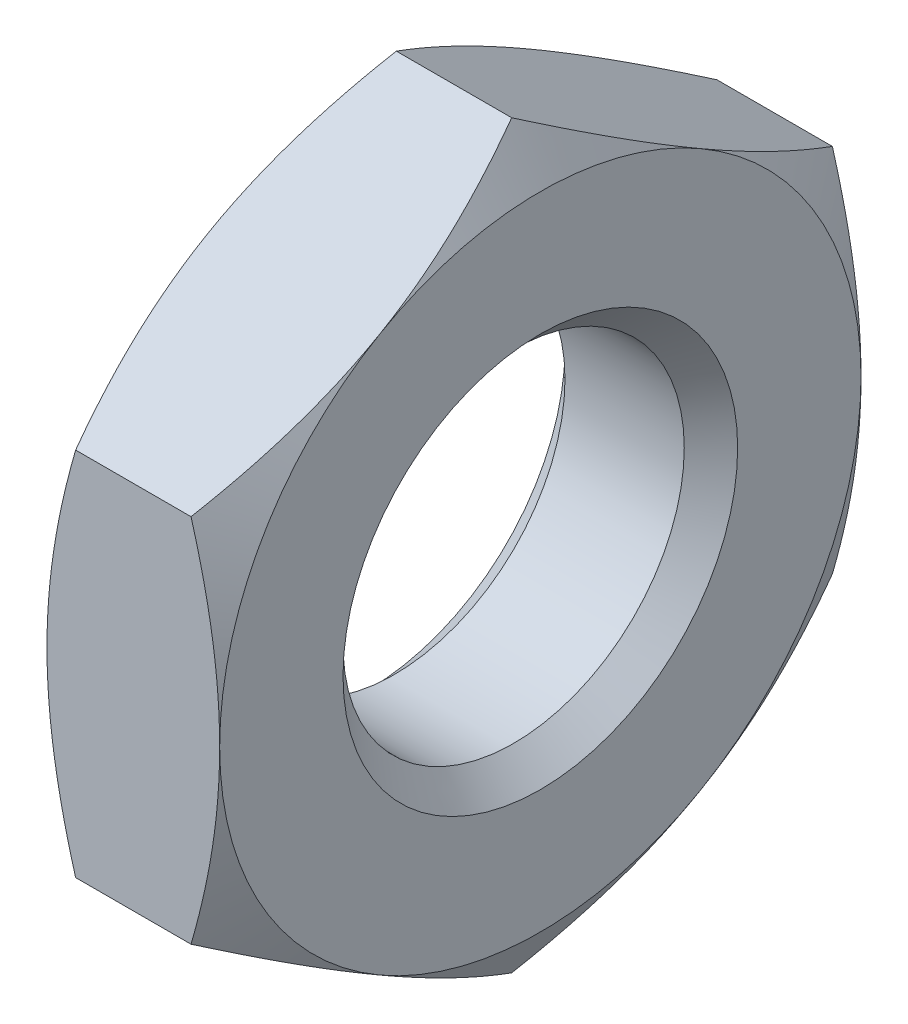
ISO-10303-21;
HEADER;
FILE_DESCRIPTION(('STEP AP214'),'2;1');
FILE_NAME('part.step','',(''),(''),'','','');
FILE_SCHEMA(('AUTOMOTIVE_DESIGN { 1 0 10303 214 1 1 1 1 }'));
ENDSEC;
DATA;
#1=APPLICATION_CONTEXT('core data for automotive mechanical design processes');
#2=APPLICATION_PROTOCOL_DEFINITION('international standard','automotive_design',2000,#1);
#3=PRODUCT_CONTEXT('',#1,'mechanical');
#4=PRODUCT('Part','Part','',(#3));
#5=PRODUCT_RELATED_PRODUCT_CATEGORY('part','',(#4));
#6=PRODUCT_DEFINITION_FORMATION('','',#4);
#7=PRODUCT_DEFINITION_CONTEXT('part definition',#1,'design');
#8=PRODUCT_DEFINITION('design','',#6,#7);
#9=PRODUCT_DEFINITION_SHAPE('','',#8);
#10=(LENGTH_UNIT() NAMED_UNIT(*) SI_UNIT(.MILLI.,.METRE.));
#11=(NAMED_UNIT(*) PLANE_ANGLE_UNIT() SI_UNIT($,.RADIAN.));
#12=(NAMED_UNIT(*) SI_UNIT($,.STERADIAN.) SOLID_ANGLE_UNIT());
#13=UNCERTAINTY_MEASURE_WITH_UNIT(LENGTH_MEASURE(1.E-05),#10,'distance_accuracy_value','');
#14=(GEOMETRIC_REPRESENTATION_CONTEXT(3) GLOBAL_UNCERTAINTY_ASSIGNED_CONTEXT((#13)) GLOBAL_UNIT_ASSIGNED_CONTEXT((#10,
#11,#12)) REPRESENTATION_CONTEXT('',''));
#15=CARTESIAN_POINT('',(0.,0.,0.));
#16=DIRECTION('',(0.,0.,1.));
#17=DIRECTION('',(1.,0.,0.));
#18=AXIS2_PLACEMENT_3D('',#15,#16,#17);
#19=CARTESIAN_POINT('',(20.,0.,0.));
#20=DIRECTION('',(1.,0.,0.));
#21=DIRECTION('',(0.,0.,1.));
#22=AXIS2_PLACEMENT_3D('',#19,#20,#21);
#23=CONICAL_SURFACE('',#22,6.5,1.0471975511966);
#24=CARTESIAN_POINT('',(20.5805572502676,7.50555465416567,1.99999999888977E-06));
#25=CARTESIAN_POINT('',(20.5329411522362,7.42306527723567,-0.142873791927455));
#26=CARTESIAN_POINT('',(20.4874862264941,7.34026834106243,-0.286282292090548));
#27=CARTESIAN_POINT('',(20.4014939227888,7.17400208014972,-0.574263903575863));
#28=CARTESIAN_POINT('',(20.3609586661771,7.09053248178623,-0.718837488828798));
#29=CARTESIAN_POINT('',(20.2475281183766,6.83878732720466,-1.15487288712335));
#30=CARTESIAN_POINT('',(20.1830111190427,6.66951807893899,-1.44805582527849));
#31=CARTESIAN_POINT('',(20.1073591259132,6.41620974890769,-1.88679872287313));
#32=CARTESIAN_POINT('',(20.0858084178639,6.33292745266913,-2.0310478913293));
#33=CARTESIAN_POINT('',(20.0496718853767,6.16598660334749,-2.32019792421309));
#34=CARTESIAN_POINT('',(20.0350854455776,6.08232808416699,-2.46509872991969));
#35=CARTESIAN_POINT('',(20.0132491881389,5.91486579606871,-2.75515192125765));
#36=CARTESIAN_POINT('',(20.0059910453223,5.83106230055643,-2.90030383333679));
#37=CARTESIAN_POINT('',(19.9989592217746,5.66338258203352,-3.19073362521733));
#38=CARTESIAN_POINT('',(19.9991853097409,5.5795063613506,-3.33601150098701));
#39=CARTESIAN_POINT('',(20.0100914728005,5.34972711742178,-3.73400082599649));
#40=CARTESIAN_POINT('',(20.0283909317871,5.20389935455449,-3.98658192043674));
#41=CARTESIAN_POINT('',(20.0864124807486,4.91321237846649,-4.49006653211969));
#42=CARTESIAN_POINT('',(20.1261543917517,4.7683541871297,-4.74096827940755));
#43=CARTESIAN_POINT('',(20.2254952028274,4.47708246697613,-5.24546569752153));
#44=CARTESIAN_POINT('',(20.285514893733,4.33070568094781,-5.49899772797121));
#45=CARTESIAN_POINT('',(20.4217344418106,4.04013468328328,-6.00228145913216));
#46=CARTESIAN_POINT('',(20.4979023128666,3.89593675196615,-6.25203960251976));
#47=CARTESIAN_POINT('',(20.5805572502676,3.75277559503203,-6.500002));
#48=B_SPLINE_CURVE_WITH_KNOTS('',3,(#24,#25,#26,#27,#28,#29,#30,#31,#32,#33,#34,#35,#36,#37,#38,
#39,#40,#41,#42,#43,#44,#45,#46,#47),.UNSPECIFIED.,.F.,.F.,(4,2,2,2,2,2,2,2,2,2,2,4),(0.,
0.5150972308121,1.03041578730196,2.0631938175307,2.56693508465117,3.07063183306576,
3.5737557200387,4.07686405782424,4.95263248446346,5.82921184659663,6.72522956997887,
7.61948878328295),.UNSPECIFIED.);
#49=CARTESIAN_POINT('',(20.,5.62916512459885,-3.25));
#50=VERTEX_POINT('',#49);
#51=CARTESIAN_POINT('',(20.5805565836007,3.75277674973256,-6.5));
#52=VERTEX_POINT('',#51);
#53=EDGE_CURVE('E233',#50,#52,#48,.T.);
#54=ORIENTED_EDGE('',*,*,#53,.T.);
#55=CARTESIAN_POINT('',(23.1104989341359,9.95307285908935,-6.5));
#56=CARTESIAN_POINT('',(22.9725830553751,9.66768488978743,-6.5));
#57=CARTESIAN_POINT('',(22.8360381273745,9.38162218475457,-6.5));
#58=CARTESIAN_POINT('',(22.5664735764141,8.8077824797937,-6.5));
#59=CARTESIAN_POINT('',(22.433454563785,8.52000519349761,-6.5));
#60=CARTESIAN_POINT('',(22.1710245296496,7.940817029875,-6.5));
#61=CARTESIAN_POINT('',(22.0416385098717,7.64939478323305,-6.5));
#62=CARTESIAN_POINT('',(21.7884236931739,7.06415509657549,-6.5));
#63=CARTESIAN_POINT('',(21.6645946065949,6.77033778235014,-6.5));
#64=CARTESIAN_POINT('',(21.4225009036852,6.17619249466497,-6.5));
#65=CARTESIAN_POINT('',(21.3043232869134,5.875828877051,-6.5));
#66=CARTESIAN_POINT('',(21.0772233740448,5.27155865332413,-6.5));
#67=CARTESIAN_POINT('',(20.9683021076494,4.96765165730143,-6.5));
#68=CARTESIAN_POINT('',(20.7626411634057,4.35643639784011,-6.5));
#69=CARTESIAN_POINT('',(20.6658755889185,4.04913693634067,-6.5));
#70=CARTESIAN_POINT('',(20.4876696862604,3.43016616038199,-6.5));
#71=CARTESIAN_POINT('',(20.4062245118597,3.11849626203733,-6.5));
#72=CARTESIAN_POINT('',(20.262609080276,2.49058681273852,-6.5));
#73=CARTESIAN_POINT('',(20.200443946994,2.17434607035871,-6.5));
#74=CARTESIAN_POINT('',(20.0995896083704,1.53800734029216,-6.5));
#75=CARTESIAN_POINT('',(20.0609004236126,1.21790934922361,-6.5));
#76=CARTESIAN_POINT('',(20.0229537732643,0.737252871284541,-6.5));
#77=CARTESIAN_POINT('',(20.0136508237313,0.577446868410647,-6.5));
#78=CARTESIAN_POINT('',(20.0018165473539,0.257576967669783,-6.5));
#79=CARTESIAN_POINT('',(19.9992851325544,0.0975130731795695,-6.5));
#80=CARTESIAN_POINT('',(20.0010619211028,-0.222530422340152,-6.5));
#81=CARTESIAN_POINT('',(20.0053682047385,-0.382510034418978,-6.5));
#82=CARTESIAN_POINT('',(20.0207112496698,-0.702148832131741,-6.5));
#83=CARTESIAN_POINT('',(20.031748347135,-0.861808001361582,-6.5));
#84=CARTESIAN_POINT('',(20.0664256973321,-1.2487675251381,-6.5));
#85=CARTESIAN_POINT('',(20.0934383147711,-1.47577055977928,-6.5));
#86=CARTESIAN_POINT('',(20.1595713659633,-1.92803729286361,-6.5));
#87=CARTESIAN_POINT('',(20.1986951044107,-2.15330049935346,-6.5));
#88=CARTESIAN_POINT('',(20.2876628717206,-2.60190162254788,-6.5));
#89=CARTESIAN_POINT('',(20.3375170362986,-2.82523750985595,-6.5));
#90=CARTESIAN_POINT('',(20.4464245194654,-3.26961152922599,-6.5));
#91=CARTESIAN_POINT('',(20.5054769714683,-3.49064987565263,-6.5));
#92=CARTESIAN_POINT('',(20.6329119477722,-3.93587314871609,-6.5));
#93=CARTESIAN_POINT('',(20.7014876979859,-4.16000238632252,-6.5));
#94=CARTESIAN_POINT('',(20.8454152109145,-4.60589181343482,-6.5));
#95=CARTESIAN_POINT('',(20.9207623000669,-4.82765352051654,-6.5));
#96=CARTESIAN_POINT('',(21.0766760952858,-5.26791804038343,-6.5));
#97=CARTESIAN_POINT('',(21.1572110352833,-5.48643217049917,-6.5));
#98=CARTESIAN_POINT('',(21.3230080720055,-5.921765035856,-6.5));
#99=CARTESIAN_POINT('',(21.4082720791541,-6.13858304495038,-6.5));
#100=CARTESIAN_POINT('',(21.495432818,-6.35461336357443,-6.5));
#101=B_SPLINE_CURVE_WITH_KNOTS('',3,(#55,#56,#57,#58,#59,#60,#61,#62,#63,#64,#65,#66,#67,#68,
#69,#70,#71,#72,#73,#74,#75,#76,#77,#78,#79,#80,#81,#82,#83,#84,#85,#86,#87,#88,#89,#90,#91,#92,
#93,#94,#95,#96,#97,#98,#99,#100),.UNSPECIFIED.,.F.,.F.,(4,2,2,2,2,2,2,2,2,2,2,2,2,2,2,2,2,2,2,
2,2,2,4),(0.,0.950909051370076,1.90198164276349,2.85849656625615,3.81496157264779,
4.78317137315413,5.75148873932465,6.71770688363885,7.68361887285431,8.64978734516563,
9.61595666461726,10.0960644432439,10.5761659857554,11.0561327615996,11.5361235112802,
12.2215554610679,12.9071746059577,13.5934442356332,14.2796492497687,14.9826753898829,
15.6852199758561,16.3838102365337,17.0826847952346),.UNSPECIFIED.);
#102=CARTESIAN_POINT('',(20.,0.,-6.5));
#103=VERTEX_POINT('',#102);
#104=EDGE_CURVE('E120',#52,#103,#101,.T.);
#105=ORIENTED_EDGE('',*,*,#104,.T.);
#106=CARTESIAN_POINT('',(20.,0.,0.));
#107=DIRECTION('',(-1.,0.,0.));
#108=DIRECTION('',(0.,0.,-1.));
#109=AXIS2_PLACEMENT_3D('',#106,#107,#108);
#110=CIRCLE('',#109,6.5);
#111=EDGE_CURVE('E265',#50,#103,#110,.T.);
#112=ORIENTED_EDGE('',*,*,#111,.F.);
#113=EDGE_LOOP('',(#54,#105,#112));
#114=FACE_BOUND('',#113,.T.);
#115=ADVANCED_FACE('F16',(#114),#23,.T.);
#116=CARTESIAN_POINT('',(20.,-5.62916512459885,-3.25));
#117=VERTEX_POINT('',#116);
#118=EDGE_CURVE('E257',#103,#117,#110,.T.);
#119=ORIENTED_EDGE('',*,*,#118,.F.);
#120=CARTESIAN_POINT('',(20.5805565836007,-3.75277674973257,-6.5));
#121=VERTEX_POINT('',#120);
#122=EDGE_CURVE('E226',#103,#121,#101,.T.);
#123=ORIENTED_EDGE('',*,*,#122,.T.);
#124=CARTESIAN_POINT('',(20.5805572502676,-3.75277559503203,-6.500002));
#125=CARTESIAN_POINT('',(20.5329411522362,-3.83526497196203,-6.35712620807255));
#126=CARTESIAN_POINT('',(20.4874862264941,-3.91806190813527,-6.21371770790945));
#127=CARTESIAN_POINT('',(20.4014939227888,-4.08432816904798,-5.92573609642414));
#128=CARTESIAN_POINT('',(20.3609586661771,-4.16779776741147,-5.7811625111712));
#129=CARTESIAN_POINT('',(20.2475281183766,-4.41954292199304,-5.34512711287665));
#130=CARTESIAN_POINT('',(20.1830111190428,-4.58881217025871,-5.05194417472151));
#131=CARTESIAN_POINT('',(20.1073591259132,-4.84212050029002,-4.61320127712687));
#132=CARTESIAN_POINT('',(20.0858084178639,-4.92540279652857,-4.4689521086707));
#133=CARTESIAN_POINT('',(20.0496718853767,-5.09234364585021,-4.17980207578691));
#134=CARTESIAN_POINT('',(20.0350854455776,-5.17600216503071,-4.03490127008031));
#135=CARTESIAN_POINT('',(20.0132491881389,-5.34346445312899,-3.74484807874235));
#136=CARTESIAN_POINT('',(20.0059910453223,-5.42726794864127,-3.5996961666632));
#137=CARTESIAN_POINT('',(19.9989592217746,-5.59494766716419,-3.30926637478267));
#138=CARTESIAN_POINT('',(19.9991853097409,-5.67882388784711,-3.16398849901299));
#139=CARTESIAN_POINT('',(20.0100914728005,-5.90860313177593,-2.76599917400351));
#140=CARTESIAN_POINT('',(20.0283909317871,-6.05443089464322,-2.51341807956326));
#141=CARTESIAN_POINT('',(20.0864124807486,-6.34511787073121,-2.0099334678803));
#142=CARTESIAN_POINT('',(20.1261543917517,-6.489976062068,-1.75903172059245));
#143=CARTESIAN_POINT('',(20.2254952028274,-6.78124778222157,-1.25453430247847));
#144=CARTESIAN_POINT('',(20.285514893733,-6.92762456824989,-1.00100227202879));
#145=CARTESIAN_POINT('',(20.4217344418106,-7.21819556591443,-0.497718540867836));
#146=CARTESIAN_POINT('',(20.4979023128666,-7.36239349723155,-0.247960397480243));
#147=CARTESIAN_POINT('',(20.5805572502676,-7.50555465416567,2.00000000016023E-06));
#148=B_SPLINE_CURVE_WITH_KNOTS('',3,(#124,#125,#126,#127,#128,#129,#130,#131,#132,#133,#134,
#135,#136,#137,#138,#139,#140,#141,#142,#143,#144,#145,#146,#147),.UNSPECIFIED.,.F.,.F.,(4,2,2,
2,2,2,2,2,2,2,2,4),(0.,0.5150972308121,1.03041578730196,2.0631938175307,2.56693508465117,
3.07063183306577,3.57375572003871,4.07686405782424,4.95263248446346,5.82921184659663,
6.72522956997887,7.61948878328295),.UNSPECIFIED.);
#149=EDGE_CURVE('E219',#121,#117,#148,.T.);
#150=ORIENTED_EDGE('',*,*,#149,.T.);
#151=EDGE_LOOP('',(#119,#123,#150));
#152=FACE_BOUND('',#151,.T.);
#153=ADVANCED_FACE('F254',(#152),#23,.T.);
#154=CARTESIAN_POINT('',(20.,-5.62916512459885,3.25));
#155=VERTEX_POINT('',#154);
#156=EDGE_CURVE('E263',#117,#155,#110,.T.);
#157=ORIENTED_EDGE('',*,*,#156,.F.);
#158=CARTESIAN_POINT('',(20.5805565836007,-7.50555349946514,0.));
#159=VERTEX_POINT('',#158);
#160=EDGE_CURVE('E210',#117,#159,#148,.T.);
#161=ORIENTED_EDGE('',*,*,#160,.T.);
#162=CARTESIAN_POINT('',(20.5805572502676,-7.50555465416567,-1.99999999954043E-06));
#163=CARTESIAN_POINT('',(20.5329411522362,-7.42306527723567,0.142873791927452));
#164=CARTESIAN_POINT('',(20.4874862264941,-7.34026834106243,0.286282292090546));
#165=CARTESIAN_POINT('',(20.4014939227888,-7.17400208014972,0.574263903575861));
#166=CARTESIAN_POINT('',(20.3609586661771,-7.09053248178623,0.718837488828797));
#167=CARTESIAN_POINT('',(20.2475281183766,-6.83878732720467,1.15487288712335));
#168=CARTESIAN_POINT('',(20.1830111190428,-6.66951807893899,1.44805582527848));
#169=CARTESIAN_POINT('',(20.1073591259132,-6.41620974890769,1.88679872287312));
#170=CARTESIAN_POINT('',(20.0858084178639,-6.33292745266914,2.0310478913293));
#171=CARTESIAN_POINT('',(20.0496718853767,-6.16598660334749,2.32019792421309));
#172=CARTESIAN_POINT('',(20.0350854455776,-6.08232808416699,2.46509872991969));
#173=CARTESIAN_POINT('',(20.0132491881389,-5.91486579606872,2.75515192125765));
#174=CARTESIAN_POINT('',(20.0059910453223,-5.83106230055643,2.90030383333679));
#175=CARTESIAN_POINT('',(19.9989592217746,-5.66338258203352,3.19073362521732));
#176=CARTESIAN_POINT('',(19.9991853097409,-5.5795063613506,3.336011500987));
#177=CARTESIAN_POINT('',(20.0100914728005,-5.34972711742178,3.73400082599649));
#178=CARTESIAN_POINT('',(20.0283909317871,-5.20389935455449,3.98658192043674));
#179=CARTESIAN_POINT('',(20.0864124807486,-4.9132123784665,4.49006653211969));
#180=CARTESIAN_POINT('',(20.1261543917517,-4.7683541871297,4.74096827940755));
#181=CARTESIAN_POINT('',(20.2254952028274,-4.47708246697613,5.24546569752153));
#182=CARTESIAN_POINT('',(20.285514893733,-4.33070568094781,5.49899772797121));
#183=CARTESIAN_POINT('',(20.4217344418106,-4.04013468328328,6.00228145913217));
#184=CARTESIAN_POINT('',(20.4979023128666,-3.89593675196615,6.25203960251976));
#185=CARTESIAN_POINT('',(20.5805572502676,-3.75277559503203,6.500002));
#186=B_SPLINE_CURVE_WITH_KNOTS('',3,(#162,#163,#164,#165,#166,#167,#168,#169,#170,#171,#172,
#173,#174,#175,#176,#177,#178,#179,#180,#181,#182,#183,#184,#185),.UNSPECIFIED.,.F.,.F.,(4,2,2,
2,2,2,2,2,2,2,2,4),(0.,0.515097230812098,1.03041578730196,2.06319381753069,2.56693508465116,
3.07063183306576,3.5737557200387,4.07686405782423,4.95263248446346,5.82921184659663,
6.72522956997887,7.61948878328295),.UNSPECIFIED.);
#187=EDGE_CURVE('E372',#159,#155,#186,.T.);
#188=ORIENTED_EDGE('',*,*,#187,.T.);
#189=EDGE_LOOP('',(#157,#161,#188));
#190=FACE_BOUND('',#189,.T.);
#191=ADVANCED_FACE('F341',(#190),#23,.T.);
#192=CARTESIAN_POINT('',(20.5805572502676,3.75277559503204,6.500002));
#193=CARTESIAN_POINT('',(20.5329411522362,3.83526497196203,6.35712620807255));
#194=CARTESIAN_POINT('',(20.4874862264941,3.91806190813527,6.21371770790945));
#195=CARTESIAN_POINT('',(20.4014939227888,4.08432816904798,5.92573609642414));
#196=CARTESIAN_POINT('',(20.3609586661771,4.16779776741147,5.7811625111712));
#197=CARTESIAN_POINT('',(20.2475281183766,4.41954292199304,5.34512711287665));
#198=CARTESIAN_POINT('',(20.1830111190427,4.58881217025871,5.05194417472151));
#199=CARTESIAN_POINT('',(20.1073591259132,4.84212050029002,4.61320127712687));
#200=CARTESIAN_POINT('',(20.0858084178639,4.92540279652857,4.46895210867069));
#201=CARTESIAN_POINT('',(20.0496718853767,5.09234364585021,4.17980207578691));
#202=CARTESIAN_POINT('',(20.0350854455776,5.17600216503071,4.03490127008031));
#203=CARTESIAN_POINT('',(20.0132491881389,5.34346445312899,3.74484807874235));
#204=CARTESIAN_POINT('',(20.0059910453223,5.42726794864127,3.5996961666632));
#205=CARTESIAN_POINT('',(19.9989592217746,5.59494766716419,3.30926637478267));
#206=CARTESIAN_POINT('',(19.9991853097409,5.67882388784711,3.16398849901299));
#207=CARTESIAN_POINT('',(20.0100914728005,5.90860313177593,2.76599917400351));
#208=CARTESIAN_POINT('',(20.0283909317871,6.05443089464322,2.51341807956326));
#209=CARTESIAN_POINT('',(20.0864124807486,6.34511787073121,2.0099334678803));
#210=CARTESIAN_POINT('',(20.1261543917517,6.489976062068,1.75903172059244));
#211=CARTESIAN_POINT('',(20.2254952028274,6.78124778222157,1.25453430247847));
#212=CARTESIAN_POINT('',(20.285514893733,6.92762456824989,1.00100227202879));
#213=CARTESIAN_POINT('',(20.4217344418106,7.21819556591443,0.497718540867836));
#214=CARTESIAN_POINT('',(20.4979023128666,7.36239349723155,0.247960397480243));
#215=CARTESIAN_POINT('',(20.5805572502676,7.50555465416567,-2.00000000021285E-06));
#216=B_SPLINE_CURVE_WITH_KNOTS('',3,(#192,#193,#194,#195,#196,#197,#198,#199,#200,#201,#202,
#203,#204,#205,#206,#207,#208,#209,#210,#211,#212,#213,#214,#215),.UNSPECIFIED.,.F.,.F.,(4,2,2,
2,2,2,2,2,2,2,2,4),(0.,0.515097230812101,1.03041578730196,2.0631938175307,2.56693508465117,
3.07063183306577,3.5737557200387,4.07686405782424,4.95263248446346,5.82921184659663,
6.72522956997887,7.61948878328295),.UNSPECIFIED.);
#217=CARTESIAN_POINT('',(20.,5.62916512459885,3.25));
#218=VERTEX_POINT('',#217);
#219=CARTESIAN_POINT('',(20.5805565836007,7.50555349946514,0.));
#220=VERTEX_POINT('',#219);
#221=EDGE_CURVE('E366',#218,#220,#216,.T.);
#222=ORIENTED_EDGE('',*,*,#221,.T.);
#223=EDGE_CURVE('E220',#220,#50,#48,.T.);
#224=ORIENTED_EDGE('',*,*,#223,.T.);
#225=EDGE_CURVE('E273',#218,#50,#110,.T.);
#226=ORIENTED_EDGE('',*,*,#225,.F.);
#227=EDGE_LOOP('',(#222,#224,#226));
#228=FACE_BOUND('',#227,.T.);
#229=ADVANCED_FACE('F349',(#228),#23,.T.);
#230=CARTESIAN_POINT('',(20.,0.,6.5));
#231=VERTEX_POINT('',#230);
#232=EDGE_CURVE('E271',#155,#231,#110,.T.);
#233=ORIENTED_EDGE('',*,*,#232,.F.);
#234=CARTESIAN_POINT('',(20.5805565836007,-3.75277674973256,6.5));
#235=VERTEX_POINT('',#234);
#236=EDGE_CURVE('E39',#155,#235,#186,.T.);
#237=ORIENTED_EDGE('',*,*,#236,.T.);
#238=CARTESIAN_POINT('',(23.1104989341359,9.95307285908936,6.5));
#239=CARTESIAN_POINT('',(22.9725830553751,9.66768488978743,6.5));
#240=CARTESIAN_POINT('',(22.8360381273745,9.38162218475457,6.5));
#241=CARTESIAN_POINT('',(22.5664735764141,8.80778247979371,6.5));
#242=CARTESIAN_POINT('',(22.433454563785,8.52000519349762,6.5));
#243=CARTESIAN_POINT('',(22.1710245296497,7.94081702987502,6.5));
#244=CARTESIAN_POINT('',(22.0416385098717,7.64939478323307,6.5));
#245=CARTESIAN_POINT('',(21.7884236931739,7.0641550965755,6.5));
#246=CARTESIAN_POINT('',(21.6645946065949,6.77033778235015,6.5));
#247=CARTESIAN_POINT('',(21.4225009036852,6.17619249466497,6.5));
#248=CARTESIAN_POINT('',(21.3043232869134,5.87582887705101,6.5));
#249=CARTESIAN_POINT('',(21.0772233740448,5.27155865332414,6.5));
#250=CARTESIAN_POINT('',(20.9683021076494,4.96765165730144,6.5));
#251=CARTESIAN_POINT('',(20.7626411634057,4.35643639784012,6.5));
#252=CARTESIAN_POINT('',(20.6658755889185,4.04913693634068,6.5));
#253=CARTESIAN_POINT('',(20.4876696862604,3.430166160382,6.5));
#254=CARTESIAN_POINT('',(20.4062245118597,3.11849626203734,6.5));
#255=CARTESIAN_POINT('',(20.262609080276,2.49058681273853,6.5));
#256=CARTESIAN_POINT('',(20.200443946994,2.17434607035872,6.5));
#257=CARTESIAN_POINT('',(20.0995896083704,1.53800734029217,6.5));
#258=CARTESIAN_POINT('',(20.0609004236126,1.21790934922362,6.5));
#259=CARTESIAN_POINT('',(20.0229537732643,0.737252871284547,6.5));
#260=CARTESIAN_POINT('',(20.0136508237313,0.577446868410652,6.5));
#261=CARTESIAN_POINT('',(20.0018165473539,0.257576967669788,6.5));
#262=CARTESIAN_POINT('',(19.9992851325544,0.0975130731795747,6.5));
#263=CARTESIAN_POINT('',(20.0010619211028,-0.222530422340147,6.5));
#264=CARTESIAN_POINT('',(20.0053682047385,-0.382510034418973,6.5));
#265=CARTESIAN_POINT('',(20.0207112496698,-0.702148832131737,6.5));
#266=CARTESIAN_POINT('',(20.031748347135,-0.861808001361578,6.5));
#267=CARTESIAN_POINT('',(20.0664256973321,-1.2487675251381,6.5));
#268=CARTESIAN_POINT('',(20.0934383147711,-1.47577055977927,6.5));
#269=CARTESIAN_POINT('',(20.1595713659633,-1.9280372928636,6.5));
#270=CARTESIAN_POINT('',(20.1986951044107,-2.15330049935345,6.5));
#271=CARTESIAN_POINT('',(20.2876628717206,-2.60190162254787,6.5));
#272=CARTESIAN_POINT('',(20.3375170362986,-2.82523750985594,6.5));
#273=CARTESIAN_POINT('',(20.4464245194654,-3.26961152922599,6.5));
#274=CARTESIAN_POINT('',(20.5054769714683,-3.49064987565262,6.5));
#275=CARTESIAN_POINT('',(20.6329119477722,-3.93587314871608,6.5));
#276=CARTESIAN_POINT('',(20.7014876979859,-4.16000238632251,6.50000000000001));
#277=CARTESIAN_POINT('',(20.8454152109145,-4.60589181343481,6.50000000000001));
#278=CARTESIAN_POINT('',(20.9207623000669,-4.82765352051654,6.50000000000001));
#279=CARTESIAN_POINT('',(21.0766760952858,-5.26791804038343,6.50000000000001));
#280=CARTESIAN_POINT('',(21.1572110352833,-5.48643217049917,6.50000000000001));
#281=CARTESIAN_POINT('',(21.3230080720055,-5.921765035856,6.5));
#282=CARTESIAN_POINT('',(21.4082720791541,-6.13858304495038,6.5));
#283=CARTESIAN_POINT('',(21.495432818,-6.35461336357443,6.5));
#284=B_SPLINE_CURVE_WITH_KNOTS('',3,(#238,#239,#240,#241,#242,#243,#244,#245,#246,#247,#248,
#249,#250,#251,#252,#253,#254,#255,#256,#257,#258,#259,#260,#261,#262,#263,#264,#265,#266,#267,
#268,#269,#270,#271,#272,#273,#274,#275,#276,#277,#278,#279,#280,#281,#282,#283),.UNSPECIFIED.,
.F.,.F.,(4,2,2,2,2,2,2,2,2,2,2,2,2,2,2,2,2,2,2,2,2,2,4),(0.,0.950909051370075,1.90198164276349,
2.85849656625615,3.81496157264779,4.78317137315413,5.75148873932465,6.71770688363885,
7.68361887285431,8.64978734516563,9.61595666461726,10.0960644432439,10.5761659857554,
11.0561327615996,11.5361235112802,12.2215554610679,12.9071746059577,13.5934442356332,
14.2796492497687,14.9826753898829,15.6852199758561,16.3838102365337,17.0826847952346),.UNSPECIFIED.);
#285=EDGE_CURVE('E11',#235,#231,#284,.F.);
#286=ORIENTED_EDGE('',*,*,#285,.T.);
#287=EDGE_LOOP('',(#233,#237,#286));
#288=FACE_BOUND('',#287,.T.);
#289=ADVANCED_FACE('F344',(#288),#23,.T.);
#290=CARTESIAN_POINT('',(20.5805565836007,3.75277674973257,6.5));
#291=VERTEX_POINT('',#290);
#292=EDGE_CURVE('E21',#231,#291,#284,.F.);
#293=ORIENTED_EDGE('',*,*,#292,.T.);
#294=EDGE_CURVE('E127',#291,#218,#216,.T.);
#295=ORIENTED_EDGE('',*,*,#294,.T.);
#296=EDGE_CURVE('E280',#231,#218,#110,.T.);
#297=ORIENTED_EDGE('',*,*,#296,.F.);
#298=EDGE_LOOP('',(#293,#295,#297));
#299=FACE_BOUND('',#298,.T.);
#300=ADVANCED_FACE('F155',(#299),#23,.T.);
#301=CARTESIAN_POINT('',(22.9183196037914,0.,0.));
#302=DIRECTION('',(-1.,0.,0.));
#303=DIRECTION('',(0.,0.,-1.));
#304=AXIS2_PLACEMENT_3D('',#301,#302,#303);
#305=CONICAL_SURFACE('',#304,7.5075,1.0471975511966);
#306=CARTESIAN_POINT('',(20.3895010658641,9.95307285908936,6.5));
#307=CARTESIAN_POINT('',(20.5274169446249,9.66768488978744,6.5));
#308=CARTESIAN_POINT('',(20.6639618726255,9.38162218475457,6.5));
#309=CARTESIAN_POINT('',(20.9335264235859,8.80778247979371,6.5));
#310=CARTESIAN_POINT('',(21.066545436215,8.52000519349762,6.5));
#311=CARTESIAN_POINT('',(21.3289754703504,7.94081702987502,6.5));
#312=CARTESIAN_POINT('',(21.4583614901283,7.64939478323306,6.5));
#313=CARTESIAN_POINT('',(21.7115763068261,7.0641550965755,6.5));
#314=CARTESIAN_POINT('',(21.8354053934051,6.77033778235014,6.5));
#315=CARTESIAN_POINT('',(22.0774990963148,6.17619249466497,6.5));
#316=CARTESIAN_POINT('',(22.1956767130866,5.875828877051,6.5));
#317=CARTESIAN_POINT('',(22.4227766259552,5.27155865332412,6.5));
#318=CARTESIAN_POINT('',(22.5316978923506,4.96765165730142,6.5));
#319=CARTESIAN_POINT('',(22.7373588365943,4.3564363978401,6.5));
#320=CARTESIAN_POINT('',(22.8341244110815,4.04913693634065,6.5));
#321=CARTESIAN_POINT('',(23.0123303137396,3.43016616038198,6.5));
#322=CARTESIAN_POINT('',(23.0937754881404,3.11849626203734,6.5));
#323=CARTESIAN_POINT('',(23.237390919724,2.49058681273853,6.5));
#324=CARTESIAN_POINT('',(23.299556053006,2.17434607035871,6.5));
#325=CARTESIAN_POINT('',(23.4004103916296,1.53800734029215,6.5));
#326=CARTESIAN_POINT('',(23.4390995763874,1.21790934922361,6.5));
#327=CARTESIAN_POINT('',(23.4770462267357,0.73725287128454,6.5));
#328=CARTESIAN_POINT('',(23.4863491762687,0.577446868410646,6.5));
#329=CARTESIAN_POINT('',(23.4981834526461,0.257576967669782,6.5));
#330=CARTESIAN_POINT('',(23.5007148674456,0.0975130731795697,6.5));
#331=CARTESIAN_POINT('',(23.4989380788972,-0.222530422340151,6.5));
#332=CARTESIAN_POINT('',(23.4946317952615,-0.382510034418975,6.5));
#333=CARTESIAN_POINT('',(23.4792887503302,-0.702148832131738,6.5));
#334=CARTESIAN_POINT('',(23.468251652865,-0.861808001361579,6.5));
#335=CARTESIAN_POINT('',(23.4335743026679,-1.2487675251381,6.5));
#336=CARTESIAN_POINT('',(23.4065616852289,-1.47577055977927,6.5));
#337=CARTESIAN_POINT('',(23.3404286340367,-1.92803729286359,6.5));
#338=CARTESIAN_POINT('',(23.3013048955893,-2.15330049935344,6.5));
#339=CARTESIAN_POINT('',(23.2123371282794,-2.60190162254787,6.5));
#340=CARTESIAN_POINT('',(23.1624829637014,-2.82523750985593,6.5));
#341=CARTESIAN_POINT('',(23.0535754805346,-3.26961152922598,6.5));
#342=CARTESIAN_POINT('',(22.9945230285317,-3.49064987565262,6.5));
#343=CARTESIAN_POINT('',(22.8670880522278,-3.93587314871608,6.5));
#344=CARTESIAN_POINT('',(22.7985123020141,-4.16000238632251,6.50000000000001));
#345=CARTESIAN_POINT('',(22.6545847890855,-4.60589181343481,6.50000000000001));
#346=CARTESIAN_POINT('',(22.5792376999331,-4.82765352051654,6.50000000000001));
#347=CARTESIAN_POINT('',(22.4233239047142,-5.26791804038343,6.50000000000001));
#348=CARTESIAN_POINT('',(22.3427889647167,-5.48643217049917,6.50000000000001));
#349=CARTESIAN_POINT('',(22.1769919279945,-5.92176503585599,6.5));
#350=CARTESIAN_POINT('',(22.0917279208459,-6.13858304495038,6.5));
#351=CARTESIAN_POINT('',(22.004567182,-6.35461336357443,6.5));
#352=B_SPLINE_CURVE_WITH_KNOTS('',3,(#306,#307,#308,#309,#310,#311,#312,#313,#314,#315,#316,
#317,#318,#319,#320,#321,#322,#323,#324,#325,#326,#327,#328,#329,#330,#331,#332,#333,#334,#335,
#336,#337,#338,#339,#340,#341,#342,#343,#344,#345,#346,#347,#348,#349,#350,#351),.UNSPECIFIED.,
.F.,.F.,(4,2,2,2,2,2,2,2,2,2,2,2,2,2,2,2,2,2,2,2,2,2,4),(0.,0.950909051370073,1.90198164276349,
2.85849656625615,3.8149615726478,4.78317137315414,5.75148873932467,6.71770688363887,
7.68361887285433,8.64978734516564,9.61595666461727,10.0960644432439,10.5761659857554,
11.0561327615996,11.5361235112802,12.2215554610679,12.9071746059577,13.5934442356332,
14.2796492497687,14.982675389883,15.6852199758561,16.3838102365337,17.0826847952346),.UNSPECIFIED.);
#353=CARTESIAN_POINT('',(23.5,0.,6.5));
#354=VERTEX_POINT('',#353);
#355=CARTESIAN_POINT('',(22.9194434163993,-3.75277674973256,6.5));
#356=VERTEX_POINT('',#355);
#357=EDGE_CURVE('E116',#354,#356,#352,.T.);
#358=ORIENTED_EDGE('',*,*,#357,.T.);
#359=CARTESIAN_POINT('',(22.9194427497324,-3.75277559503203,6.500002));
#360=CARTESIAN_POINT('',(22.9670588477638,-3.83526497196202,6.35712620807255));
#361=CARTESIAN_POINT('',(23.0125137735059,-3.91806190813526,6.21371770790945));
#362=CARTESIAN_POINT('',(23.0985060772112,-4.08432816904797,5.92573609642414));
#363=CARTESIAN_POINT('',(23.1390413338229,-4.16779776741147,5.7811625111712));
#364=CARTESIAN_POINT('',(23.2524718816234,-4.41954292199303,5.34512711287665));
#365=CARTESIAN_POINT('',(23.3169888809573,-4.5888121702587,5.05194417472152));
#366=CARTESIAN_POINT('',(23.3926408740868,-4.84212050029001,4.61320127712687));
#367=CARTESIAN_POINT('',(23.4141915821361,-4.92540279652856,4.4689521086707));
#368=CARTESIAN_POINT('',(23.4503281146233,-5.0923436458502,4.17980207578691));
#369=CARTESIAN_POINT('',(23.4649145544224,-5.1760021650307,4.03490127008031));
#370=CARTESIAN_POINT('',(23.4867508118611,-5.34346445312898,3.74484807874235));
#371=CARTESIAN_POINT('',(23.4940089546777,-5.42726794864126,3.59969616666321));
#372=CARTESIAN_POINT('',(23.5010407782254,-5.59494766716418,3.30926637478268));
#373=CARTESIAN_POINT('',(23.5008146902591,-5.6788238878471,3.163988499013));
#374=CARTESIAN_POINT('',(23.4899085271995,-5.90860313177592,2.76599917400351));
#375=CARTESIAN_POINT('',(23.4716090682129,-6.05443089464321,2.51341807956326));
#376=CARTESIAN_POINT('',(23.4135875192514,-6.3451178707312,2.0099334678803));
#377=CARTESIAN_POINT('',(23.3738456082483,-6.48997606206799,1.75903172059244));
#378=CARTESIAN_POINT('',(23.2745047971726,-6.78124778222157,1.25453430247847));
#379=CARTESIAN_POINT('',(23.214485106267,-6.92762456824988,1.00100227202879));
#380=CARTESIAN_POINT('',(23.0782655581894,-7.21819556591442,0.497718540867834));
#381=CARTESIAN_POINT('',(23.0020976871334,-7.36239349723155,0.247960397480242));
#382=CARTESIAN_POINT('',(22.9194427497324,-7.50555465416567,-1.99999999926572E-06));
#383=B_SPLINE_CURVE_WITH_KNOTS('',3,(#359,#360,#361,#362,#363,#364,#365,#366,#367,#368,#369,
#370,#371,#372,#373,#374,#375,#376,#377,#378,#379,#380,#381,#382),.UNSPECIFIED.,.F.,.F.,(4,2,2,
2,2,2,2,2,2,2,2,4),(0.,0.515097230812099,1.03041578730196,2.0631938175307,2.56693508465116,
3.07063183306576,3.5737557200387,4.07686405782424,4.95263248446346,5.82921184659663,
6.72522956997888,7.61948878328295),.UNSPECIFIED.);
#384=CARTESIAN_POINT('',(23.5,-5.62916512459885,3.25));
#385=VERTEX_POINT('',#384);
#386=EDGE_CURVE('E122',#356,#385,#383,.T.);
#387=ORIENTED_EDGE('',*,*,#386,.T.);
#388=CARTESIAN_POINT('',(23.5,0.,0.));
#389=DIRECTION('',(-1.,0.,0.));
#390=DIRECTION('',(0.,0.,-1.));
#391=AXIS2_PLACEMENT_3D('',#388,#389,#390);
#392=CIRCLE('',#391,6.5);
#393=EDGE_CURVE('E130',#385,#354,#392,.T.);
#394=ORIENTED_EDGE('',*,*,#393,.T.);
#395=EDGE_LOOP('',(#358,#387,#394));
#396=FACE_BOUND('',#395,.T.);
#397=ADVANCED_FACE('F129',(#396),#305,.T.);
#398=CARTESIAN_POINT('',(23.5,-5.62916512459885,-3.25));
#399=VERTEX_POINT('',#398);
#400=EDGE_CURVE('E283',#399,#385,#392,.T.);
#401=ORIENTED_EDGE('',*,*,#400,.T.);
#402=CARTESIAN_POINT('',(22.9194434163993,-7.50555349946514,0.));
#403=VERTEX_POINT('',#402);
#404=EDGE_CURVE('E46',#385,#403,#383,.T.);
#405=ORIENTED_EDGE('',*,*,#404,.T.);
#406=CARTESIAN_POINT('',(22.9194427497324,-7.50555465416567,2.00000000051254E-06));
#407=CARTESIAN_POINT('',(22.9670588477638,-7.42306527723568,-0.142873791927454));
#408=CARTESIAN_POINT('',(23.0125137735059,-7.34026834106244,-0.286282292090549));
#409=CARTESIAN_POINT('',(23.0985060772112,-7.17400208014973,-0.574263903575866));
#410=CARTESIAN_POINT('',(23.1390413338229,-7.09053248178624,-0.718837488828801));
#411=CARTESIAN_POINT('',(23.2524718816234,-6.83878732720467,-1.15487288712335));
#412=CARTESIAN_POINT('',(23.3169888809572,-6.669518078939,-1.44805582527849));
#413=CARTESIAN_POINT('',(23.3926408740868,-6.4162097489077,-1.88679872287313));
#414=CARTESIAN_POINT('',(23.4141915821361,-6.33292745266914,-2.03104789132931));
#415=CARTESIAN_POINT('',(23.4503281146233,-6.1659866033475,-2.32019792421309));
#416=CARTESIAN_POINT('',(23.4649145544224,-6.082328084167,-2.4650987299197));
#417=CARTESIAN_POINT('',(23.4867508118611,-5.91486579606872,-2.75515192125765));
#418=CARTESIAN_POINT('',(23.4940089546777,-5.83106230055644,-2.9003038333368));
#419=CARTESIAN_POINT('',(23.5010407782254,-5.66338258203352,-3.19073362521733));
#420=CARTESIAN_POINT('',(23.5008146902591,-5.5795063613506,-3.33601150098701));
#421=CARTESIAN_POINT('',(23.4899085271995,-5.34972711742178,-3.73400082599649));
#422=CARTESIAN_POINT('',(23.4716090682129,-5.20389935455449,-3.98658192043674));
#423=CARTESIAN_POINT('',(23.4135875192514,-4.9132123784665,-4.4900665321197));
#424=CARTESIAN_POINT('',(23.3738456082483,-4.76835418712971,-4.74096827940756));
#425=CARTESIAN_POINT('',(23.2745047971726,-4.47708246697614,-5.24546569752153));
#426=CARTESIAN_POINT('',(23.214485106267,-4.33070568094782,-5.49899772797121));
#427=CARTESIAN_POINT('',(23.0782655581894,-4.04013468328328,-6.00228145913217));
#428=CARTESIAN_POINT('',(23.0020976871334,-3.89593675196615,-6.25203960251976));
#429=CARTESIAN_POINT('',(22.9194427497324,-3.75277559503203,-6.500002));
#430=B_SPLINE_CURVE_WITH_KNOTS('',3,(#406,#407,#408,#409,#410,#411,#412,#413,#414,#415,#416,
#417,#418,#419,#420,#421,#422,#423,#424,#425,#426,#427,#428,#429),.UNSPECIFIED.,.F.,.F.,(4,2,2,
2,2,2,2,2,2,2,2,4),(0.,0.515097230812099,1.03041578730196,2.0631938175307,2.56693508465116,
3.07063183306576,3.5737557200387,4.07686405782424,4.95263248446346,5.82921184659663,
6.72522956997887,7.61948878328295),.UNSPECIFIED.);
#431=EDGE_CURVE('E195',#403,#399,#430,.T.);
#432=ORIENTED_EDGE('',*,*,#431,.T.);
#433=EDGE_LOOP('',(#401,#405,#432));
#434=FACE_BOUND('',#433,.T.);
#435=ADVANCED_FACE('F154',(#434),#305,.T.);
#436=CARTESIAN_POINT('',(23.5,0.,-6.5));
#437=VERTEX_POINT('',#436);
#438=EDGE_CURVE('E274',#437,#399,#392,.T.);
#439=ORIENTED_EDGE('',*,*,#438,.T.);
#440=CARTESIAN_POINT('',(22.9194434163993,-3.75277674973257,-6.5));
#441=VERTEX_POINT('',#440);
#442=EDGE_CURVE('E188',#399,#441,#430,.T.);
#443=ORIENTED_EDGE('',*,*,#442,.T.);
#444=CARTESIAN_POINT('',(20.3895010658641,9.95307285908935,-6.5));
#445=CARTESIAN_POINT('',(20.5274169446249,9.66768488978743,-6.5));
#446=CARTESIAN_POINT('',(20.6639618726255,9.38162218475457,-6.5));
#447=CARTESIAN_POINT('',(20.9335264235859,8.8077824797937,-6.5));
#448=CARTESIAN_POINT('',(21.066545436215,8.52000519349761,-6.5));
#449=CARTESIAN_POINT('',(21.3289754703504,7.94081702987501,-6.5));
#450=CARTESIAN_POINT('',(21.4583614901283,7.64939478323306,-6.5));
#451=CARTESIAN_POINT('',(21.7115763068261,7.06415509657549,-6.5));
#452=CARTESIAN_POINT('',(21.8354053934051,6.77033778235013,-6.5));
#453=CARTESIAN_POINT('',(22.0774990963148,6.17619249466496,-6.5));
#454=CARTESIAN_POINT('',(22.1956767130866,5.87582887705099,-6.5));
#455=CARTESIAN_POINT('',(22.4227766259552,5.27155865332412,-6.5));
#456=CARTESIAN_POINT('',(22.5316978923506,4.96765165730141,-6.5));
#457=CARTESIAN_POINT('',(22.7373588365943,4.35643639784009,-6.5));
#458=CARTESIAN_POINT('',(22.8341244110815,4.04913693634065,-6.5));
#459=CARTESIAN_POINT('',(23.0123303137396,3.43016616038198,-6.5));
#460=CARTESIAN_POINT('',(23.0937754881404,3.11849626203734,-6.5));
#461=CARTESIAN_POINT('',(23.237390919724,2.49058681273853,-6.5));
#462=CARTESIAN_POINT('',(23.299556053006,2.17434607035872,-6.5));
#463=CARTESIAN_POINT('',(23.4004103916296,1.53800734029216,-6.5));
#464=CARTESIAN_POINT('',(23.4390995763874,1.21790934922361,-6.5));
#465=CARTESIAN_POINT('',(23.4770462267357,0.73725287128454,-6.5));
#466=CARTESIAN_POINT('',(23.4863491762687,0.577446868410646,-6.5));
#467=CARTESIAN_POINT('',(23.4981834526461,0.257576967669781,-6.5));
#468=CARTESIAN_POINT('',(23.5007148674456,0.097513073179568,-6.5));
#469=CARTESIAN_POINT('',(23.4989380788972,-0.222530422340153,-6.5));
#470=CARTESIAN_POINT('',(23.4946317952615,-0.382510034418978,-6.5));
#471=CARTESIAN_POINT('',(23.4792887503302,-0.702148832131741,-6.5));
#472=CARTESIAN_POINT('',(23.468251652865,-0.861808001361583,-6.5));
#473=CARTESIAN_POINT('',(23.4335743026679,-1.2487675251381,-6.5));
#474=CARTESIAN_POINT('',(23.4065616852289,-1.47577055977927,-6.5));
#475=CARTESIAN_POINT('',(23.3404286340367,-1.92803729286359,-6.5));
#476=CARTESIAN_POINT('',(23.3013048955893,-2.15330049935344,-6.5));
#477=CARTESIAN_POINT('',(23.2123371282794,-2.60190162254787,-6.5));
#478=CARTESIAN_POINT('',(23.1624829637014,-2.82523750985594,-6.5));
#479=CARTESIAN_POINT('',(23.0535754805346,-3.26961152922599,-6.5));
#480=CARTESIAN_POINT('',(22.9945230285317,-3.49064987565262,-6.5));
#481=CARTESIAN_POINT('',(22.8670880522278,-3.93587314871608,-6.5));
#482=CARTESIAN_POINT('',(22.7985123020141,-4.16000238632252,-6.5));
#483=CARTESIAN_POINT('',(22.6545847890855,-4.60589181343482,-6.5));
#484=CARTESIAN_POINT('',(22.5792376999331,-4.82765352051655,-6.5));
#485=CARTESIAN_POINT('',(22.4233239047142,-5.26791804038344,-6.5));
#486=CARTESIAN_POINT('',(22.3427889647167,-5.48643217049917,-6.5));
#487=CARTESIAN_POINT('',(22.1769919279945,-5.921765035856,-6.5));
#488=CARTESIAN_POINT('',(22.0917279208459,-6.13858304495038,-6.5));
#489=CARTESIAN_POINT('',(22.004567182,-6.35461336357443,-6.5));
#490=B_SPLINE_CURVE_WITH_KNOTS('',3,(#444,#445,#446,#447,#448,#449,#450,#451,#452,#453,#454,
#455,#456,#457,#458,#459,#460,#461,#462,#463,#464,#465,#466,#467,#468,#469,#470,#471,#472,#473,
#474,#475,#476,#477,#478,#479,#480,#481,#482,#483,#484,#485,#486,#487,#488,#489),.UNSPECIFIED.,
.F.,.F.,(4,2,2,2,2,2,2,2,2,2,2,2,2,2,2,2,2,2,2,2,2,2,4),(0.,0.950909051370073,1.90198164276348,
2.85849656625615,3.8149615726478,4.78317137315414,5.75148873932467,6.71770688363887,
7.68361887285432,8.64978734516563,9.61595666461726,10.0960644432439,10.5761659857554,
11.0561327615996,11.5361235112802,12.2215554610679,12.9071746059577,13.5934442356332,
14.2796492497687,14.982675389883,15.6852199758561,16.3838102365337,17.0826847952346),.UNSPECIFIED.);
#491=EDGE_CURVE('E196',#441,#437,#490,.F.);
#492=ORIENTED_EDGE('',*,*,#491,.T.);
#493=EDGE_LOOP('',(#439,#443,#492));
#494=FACE_BOUND('',#493,.T.);
#495=ADVANCED_FACE('F452',(#494),#305,.T.);
#496=CARTESIAN_POINT('',(23.5,5.62916512459885,-3.25));
#497=VERTEX_POINT('',#496);
#498=EDGE_CURVE('E284',#497,#437,#392,.T.);
#499=ORIENTED_EDGE('',*,*,#498,.T.);
#500=CARTESIAN_POINT('',(22.9194434163993,3.75277674973256,-6.5));
#501=VERTEX_POINT('',#500);
#502=EDGE_CURVE('E181',#437,#501,#490,.F.);
#503=ORIENTED_EDGE('',*,*,#502,.T.);
#504=CARTESIAN_POINT('',(22.9194427497324,3.75277559503203,-6.500002));
#505=CARTESIAN_POINT('',(22.9670588477638,3.83526497196202,-6.35712620807255));
#506=CARTESIAN_POINT('',(23.0125137735059,3.91806190813527,-6.21371770790945));
#507=CARTESIAN_POINT('',(23.0985060772112,4.08432816904797,-5.92573609642414));
#508=CARTESIAN_POINT('',(23.1390413338229,4.16779776741147,-5.7811625111712));
#509=CARTESIAN_POINT('',(23.2524718816234,4.41954292199303,-5.34512711287665));
#510=CARTESIAN_POINT('',(23.3169888809573,4.5888121702587,-5.05194417472151));
#511=CARTESIAN_POINT('',(23.3926408740868,4.84212050029001,-4.61320127712687));
#512=CARTESIAN_POINT('',(23.4141915821361,4.92540279652856,-4.4689521086707));
#513=CARTESIAN_POINT('',(23.4503281146233,5.0923436458502,-4.17980207578691));
#514=CARTESIAN_POINT('',(23.4649145544224,5.1760021650307,-4.03490127008031));
#515=CARTESIAN_POINT('',(23.4867508118611,5.34346445312898,-3.74484807874235));
#516=CARTESIAN_POINT('',(23.4940089546777,5.42726794864126,-3.59969616666321));
#517=CARTESIAN_POINT('',(23.5010407782254,5.59494766716418,-3.30926637478267));
#518=CARTESIAN_POINT('',(23.5008146902591,5.6788238878471,-3.16398849901299));
#519=CARTESIAN_POINT('',(23.4899085271995,5.90860313177592,-2.76599917400351));
#520=CARTESIAN_POINT('',(23.4716090682129,6.05443089464321,-2.51341807956326));
#521=CARTESIAN_POINT('',(23.4135875192514,6.3451178707312,-2.0099334678803));
#522=CARTESIAN_POINT('',(23.3738456082483,6.48997606206799,-1.75903172059245));
#523=CARTESIAN_POINT('',(23.2745047971726,6.78124778222157,-1.25453430247847));
#524=CARTESIAN_POINT('',(23.214485106267,6.92762456824988,-1.00100227202879));
#525=CARTESIAN_POINT('',(23.0782655581894,7.21819556591442,-0.497718540867834));
#526=CARTESIAN_POINT('',(23.0020976871334,7.36239349723155,-0.247960397480242));
#527=CARTESIAN_POINT('',(22.9194427497324,7.50555465416567,1.9999999985867E-06));
#528=B_SPLINE_CURVE_WITH_KNOTS('',3,(#504,#505,#506,#507,#508,#509,#510,#511,#512,#513,#514,
#515,#516,#517,#518,#519,#520,#521,#522,#523,#524,#525,#526,#527),.UNSPECIFIED.,.F.,.F.,(4,2,2,
2,2,2,2,2,2,2,2,4),(0.,0.515097230812098,1.03041578730196,2.0631938175307,2.56693508465116,
3.07063183306576,3.5737557200387,4.07686405782423,4.95263248446346,5.82921184659663,
6.72522956997887,7.61948878328295),.UNSPECIFIED.);
#529=EDGE_CURVE('E419',#501,#497,#528,.T.);
#530=ORIENTED_EDGE('',*,*,#529,.T.);
#531=EDGE_LOOP('',(#499,#503,#530));
#532=FACE_BOUND('',#531,.T.);
#533=ADVANCED_FACE('F448',(#532),#305,.T.);
#534=CARTESIAN_POINT('',(23.5,5.62916512459885,3.25));
#535=VERTEX_POINT('',#534);
#536=EDGE_CURVE('E294',#535,#497,#392,.T.);
#537=ORIENTED_EDGE('',*,*,#536,.T.);
#538=CARTESIAN_POINT('',(22.9194434163993,7.50555349946514,0.));
#539=VERTEX_POINT('',#538);
#540=EDGE_CURVE('E174',#497,#539,#528,.T.);
#541=ORIENTED_EDGE('',*,*,#540,.T.);
#542=CARTESIAN_POINT('',(22.9194427497324,7.50555465416567,-2.0000000012458E-06));
#543=CARTESIAN_POINT('',(22.9670588477638,7.42306527723568,0.142873791927454));
#544=CARTESIAN_POINT('',(23.0125137735059,7.34026834106244,0.286282292090549));
#545=CARTESIAN_POINT('',(23.0985060772112,7.17400208014973,0.574263903575865));
#546=CARTESIAN_POINT('',(23.1390413338229,7.09053248178624,0.7188374888288));
#547=CARTESIAN_POINT('',(23.2524718816234,6.83878732720467,1.15487288712335));
#548=CARTESIAN_POINT('',(23.3169888809572,6.669518078939,1.44805582527849));
#549=CARTESIAN_POINT('',(23.3926408740868,6.41620974890769,1.88679872287313));
#550=CARTESIAN_POINT('',(23.4141915821361,6.33292745266914,2.03104789132931));
#551=CARTESIAN_POINT('',(23.4503281146233,6.1659866033475,2.32019792421309));
#552=CARTESIAN_POINT('',(23.4649145544224,6.082328084167,2.4650987299197));
#553=CARTESIAN_POINT('',(23.4867508118611,5.91486579606872,2.75515192125765));
#554=CARTESIAN_POINT('',(23.4940089546777,5.83106230055644,2.9003038333368));
#555=CARTESIAN_POINT('',(23.5010407782254,5.66338258203352,3.19073362521733));
#556=CARTESIAN_POINT('',(23.5008146902591,5.5795063613506,3.33601150098701));
#557=CARTESIAN_POINT('',(23.4899085271995,5.34972711742178,3.73400082599649));
#558=CARTESIAN_POINT('',(23.4716090682129,5.20389935455449,3.98658192043674));
#559=CARTESIAN_POINT('',(23.4135875192514,4.9132123784665,4.4900665321197));
#560=CARTESIAN_POINT('',(23.3738456082483,4.76835418712971,4.74096827940756));
#561=CARTESIAN_POINT('',(23.2745047971726,4.47708246697614,5.24546569752153));
#562=CARTESIAN_POINT('',(23.214485106267,4.33070568094782,5.49899772797121));
#563=CARTESIAN_POINT('',(23.0782655581894,4.04013468328328,6.00228145913217));
#564=CARTESIAN_POINT('',(23.0020976871334,3.89593675196616,6.25203960251976));
#565=CARTESIAN_POINT('',(22.9194427497324,3.75277559503204,6.500002));
#566=B_SPLINE_CURVE_WITH_KNOTS('',3,(#542,#543,#544,#545,#546,#547,#548,#549,#550,#551,#552,
#553,#554,#555,#556,#557,#558,#559,#560,#561,#562,#563,#564,#565),.UNSPECIFIED.,.F.,.F.,(4,2,2,
2,2,2,2,2,2,2,2,4),(0.,0.515097230812098,1.03041578730196,2.0631938175307,2.56693508465117,
3.07063183306577,3.5737557200387,4.07686405782424,4.95263248446346,5.82921184659663,
6.72522956997887,7.61948878328295),.UNSPECIFIED.);
#567=EDGE_CURVE('E403',#539,#535,#566,.T.);
#568=ORIENTED_EDGE('',*,*,#567,.T.);
#569=EDGE_LOOP('',(#537,#541,#568));
#570=FACE_BOUND('',#569,.T.);
#571=ADVANCED_FACE('F334',(#570),#305,.T.);
#572=EDGE_CURVE('E305',#354,#535,#392,.T.);
#573=ORIENTED_EDGE('',*,*,#572,.T.);
#574=CARTESIAN_POINT('',(22.9194434163993,3.75277674973257,6.5));
#575=VERTEX_POINT('',#574);
#576=EDGE_CURVE('E166',#535,#575,#566,.T.);
#577=ORIENTED_EDGE('',*,*,#576,.T.);
#578=EDGE_CURVE('E132',#575,#354,#352,.T.);
#579=ORIENTED_EDGE('',*,*,#578,.T.);
#580=EDGE_LOOP('',(#573,#577,#579));
#581=FACE_BOUND('',#580,.T.);
#582=ADVANCED_FACE('F156',(#581),#305,.T.);
#583=CARTESIAN_POINT('',(20.54125,0.,0.));
#584=DIRECTION('',(-1.,0.,0.));
#585=DIRECTION('',(0.,0.,-1.));
#586=AXIS2_PLACEMENT_3D('',#583,#584,#585);
#587=CONICAL_SURFACE('',#586,3.45875,0.785398163397448);
#588=CARTESIAN_POINT('',(20.,0.,0.));
#589=DIRECTION('',(-1.,0.,0.));
#590=DIRECTION('',(0.,0.,-1.));
#591=AXIS2_PLACEMENT_3D('',#588,#589,#590);
#592=CIRCLE('',#591,4.);
#593=CARTESIAN_POINT('',(20.,0.,-4.));
#594=VERTEX_POINT('',#593);
#595=EDGE_CURVE('E262',#594,#594,#592,.T.);
#596=ORIENTED_EDGE('',*,*,#595,.T.);
#597=EDGE_LOOP('',(#596));
#598=FACE_BOUND('',#597,.T.);
#599=CARTESIAN_POINT('',(20.54125,0.,0.));
#600=DIRECTION('',(-1.,0.,0.));
#601=DIRECTION('',(0.,0.,-1.));
#602=AXIS2_PLACEMENT_3D('',#599,#600,#601);
#603=CIRCLE('',#602,3.45875);
#604=CARTESIAN_POINT('',(20.54125,0.,-3.45875));
#605=VERTEX_POINT('',#604);
#606=EDGE_CURVE('E315',#605,#605,#603,.T.);
#607=ORIENTED_EDGE('',*,*,#606,.F.);
#608=EDGE_LOOP('',(#607));
#609=FACE_BOUND('',#608,.T.);
#610=ADVANCED_FACE('F325',(#598,#609),#587,.F.);
#611=CARTESIAN_POINT('',(20.,-4.,0.));
#612=DIRECTION('',(-1.,0.,0.));
#613=DIRECTION('',(0.,0.,-1.));
#614=AXIS2_PLACEMENT_3D('',#611,#612,#613);
#615=PLANE('',#614);
#616=ORIENTED_EDGE('',*,*,#118,.T.);
#617=ORIENTED_EDGE('',*,*,#156,.T.);
#618=ORIENTED_EDGE('',*,*,#232,.T.);
#619=ORIENTED_EDGE('',*,*,#296,.T.);
#620=ORIENTED_EDGE('',*,*,#225,.T.);
#621=ORIENTED_EDGE('',*,*,#111,.T.);
#622=EDGE_LOOP('',(#616,#617,#618,#619,#620,#621));
#623=FACE_BOUND('',#622,.T.);
#624=ORIENTED_EDGE('',*,*,#595,.F.);
#625=EDGE_LOOP('',(#624));
#626=FACE_BOUND('',#625,.T.);
#627=ADVANCED_FACE('F327',(#623,#626),#615,.T.);
#628=CARTESIAN_POINT('',(23.5,-6.5,0.));
#629=DIRECTION('',(1.,0.,0.));
#630=DIRECTION('',(0.,0.,1.));
#631=AXIS2_PLACEMENT_3D('',#628,#629,#630);
#632=PLANE('',#631);
#633=CARTESIAN_POINT('',(23.5,0.,0.));
#634=DIRECTION('',(-1.,0.,0.));
#635=DIRECTION('',(0.,0.,-1.));
#636=AXIS2_PLACEMENT_3D('',#633,#634,#635);
#637=CIRCLE('',#636,4.);
#638=CARTESIAN_POINT('',(23.5,0.,-4.));
#639=VERTEX_POINT('',#638);
#640=EDGE_CURVE('E295',#639,#639,#637,.T.);
#641=ORIENTED_EDGE('',*,*,#640,.T.);
#642=EDGE_LOOP('',(#641));
#643=FACE_BOUND('',#642,.T.);
#644=ORIENTED_EDGE('',*,*,#438,.F.);
#645=ORIENTED_EDGE('',*,*,#498,.F.);
#646=ORIENTED_EDGE('',*,*,#536,.F.);
#647=ORIENTED_EDGE('',*,*,#572,.F.);
#648=ORIENTED_EDGE('',*,*,#393,.F.);
#649=ORIENTED_EDGE('',*,*,#400,.F.);
#650=EDGE_LOOP('',(#644,#645,#646,#647,#648,#649));
#651=FACE_BOUND('',#650,.T.);
#652=ADVANCED_FACE('F157',(#643,#651),#632,.T.);
#653=CARTESIAN_POINT('',(23.5,0.,0.));
#654=DIRECTION('',(1.,0.,0.));
#655=DIRECTION('',(0.,0.,1.));
#656=AXIS2_PLACEMENT_3D('',#653,#654,#655);
#657=CONICAL_SURFACE('',#656,4.,0.785398163397448);
#658=CARTESIAN_POINT('',(22.95875,0.,0.));
#659=DIRECTION('',(-1.,0.,0.));
#660=DIRECTION('',(0.,0.,-1.));
#661=AXIS2_PLACEMENT_3D('',#658,#659,#660);
#662=CIRCLE('',#661,3.45875);
#663=CARTESIAN_POINT('',(22.95875,0.,-3.45875));
#664=VERTEX_POINT('',#663);
#665=EDGE_CURVE('E308',#664,#664,#662,.T.);
#666=ORIENTED_EDGE('',*,*,#665,.T.);
#667=EDGE_LOOP('',(#666));
#668=FACE_BOUND('',#667,.T.);
#669=ORIENTED_EDGE('',*,*,#640,.F.);
#670=EDGE_LOOP('',(#669));
#671=FACE_BOUND('',#670,.T.);
#672=ADVANCED_FACE('F566',(#668,#671),#657,.F.);
#673=CARTESIAN_POINT('',(20.,0.,0.));
#674=DIRECTION('',(-1.,0.,0.));
#675=DIRECTION('',(0.,0.,-1.));
#676=AXIS2_PLACEMENT_3D('',#673,#674,#675);
#677=CYLINDRICAL_SURFACE('',#676,3.45875);
#678=ORIENTED_EDGE('',*,*,#606,.T.);
#679=EDGE_LOOP('',(#678));
#680=FACE_BOUND('',#679,.T.);
#681=ORIENTED_EDGE('',*,*,#665,.F.);
#682=EDGE_LOOP('',(#681));
#683=FACE_BOUND('',#682,.T.);
#684=ADVANCED_FACE('F322',(#680,#683),#677,.F.);
#685=CARTESIAN_POINT('',(24.5,-3.75277674973256,6.5));
#686=DIRECTION('',(0.,0.866025403784439,-0.5));
#687=DIRECTION('',(0.,0.5,0.866025403784439));
#688=AXIS2_PLACEMENT_3D('',#685,#686,#687);
#689=PLANE('',#688);
#690=ORIENTED_EDGE('',*,*,#187,.F.);
#691=DIRECTION('',(-1.,0.,0.));
#692=VECTOR('',#691,1.);
#693=CARTESIAN_POINT('',(24.5,-7.50555349946514,0.));
#694=LINE('',#693,#692);
#695=EDGE_CURVE('E133',#403,#159,#694,.T.);
#696=ORIENTED_EDGE('',*,*,#695,.F.);
#697=ORIENTED_EDGE('',*,*,#404,.F.);
#698=ORIENTED_EDGE('',*,*,#386,.F.);
#699=DIRECTION('',(-1.,0.,0.));
#700=VECTOR('',#699,1.);
#701=CARTESIAN_POINT('',(24.5,-3.75277674973256,6.5));
#702=LINE('',#701,#700);
#703=EDGE_CURVE('E113',#356,#235,#702,.T.);
#704=ORIENTED_EDGE('',*,*,#703,.T.);
#705=ORIENTED_EDGE('',*,*,#236,.F.);
#706=EDGE_LOOP('',(#690,#696,#697,#698,#704,#705));
#707=FACE_BOUND('',#706,.T.);
#708=ADVANCED_FACE('F18',(#707),#689,.F.);
#709=CARTESIAN_POINT('',(24.5,-7.50555349946514,0.));
#710=DIRECTION('',(0.,0.866025403784439,0.5));
#711=DIRECTION('',(0.,-0.5,0.866025403784439));
#712=AXIS2_PLACEMENT_3D('',#709,#710,#711);
#713=PLANE('',#712);
#714=ORIENTED_EDGE('',*,*,#149,.F.);
#715=DIRECTION('',(-1.,0.,0.));
#716=VECTOR('',#715,1.);
#717=CARTESIAN_POINT('',(24.5,-3.75277674973257,-6.5));
#718=LINE('',#717,#716);
#719=EDGE_CURVE('E140',#441,#121,#718,.T.);
#720=ORIENTED_EDGE('',*,*,#719,.F.);
#721=ORIENTED_EDGE('',*,*,#442,.F.);
#722=ORIENTED_EDGE('',*,*,#431,.F.);
#723=ORIENTED_EDGE('',*,*,#695,.T.);
#724=ORIENTED_EDGE('',*,*,#160,.F.);
#725=EDGE_LOOP('',(#714,#720,#721,#722,#723,#724));
#726=FACE_BOUND('',#725,.T.);
#727=ADVANCED_FACE('F202',(#726),#713,.F.);
#728=CARTESIAN_POINT('',(24.5,-3.75277674973257,-6.5));
#729=DIRECTION('',(0.,0.,1.));
#730=DIRECTION('',(0.,-1.,0.));
#731=AXIS2_PLACEMENT_3D('',#728,#729,#730);
#732=PLANE('',#731);
#733=ORIENTED_EDGE('',*,*,#104,.F.);
#734=DIRECTION('',(-1.,0.,0.));
#735=VECTOR('',#734,1.);
#736=CARTESIAN_POINT('',(24.5,3.75277674973256,-6.5));
#737=LINE('',#736,#735);
#738=EDGE_CURVE('E241',#501,#52,#737,.T.);
#739=ORIENTED_EDGE('',*,*,#738,.F.);
#740=ORIENTED_EDGE('',*,*,#502,.F.);
#741=ORIENTED_EDGE('',*,*,#491,.F.);
#742=ORIENTED_EDGE('',*,*,#719,.T.);
#743=ORIENTED_EDGE('',*,*,#122,.F.);
#744=EDGE_LOOP('',(#733,#739,#740,#741,#742,#743));
#745=FACE_BOUND('',#744,.T.);
#746=ADVANCED_FACE('F205',(#745),#732,.F.);
#747=CARTESIAN_POINT('',(24.5,3.75277674973256,-6.5));
#748=DIRECTION('',(0.,-0.866025403784439,0.5));
#749=DIRECTION('',(0.,-0.5,-0.866025403784439));
#750=AXIS2_PLACEMENT_3D('',#747,#748,#749);
#751=PLANE('',#750);
#752=ORIENTED_EDGE('',*,*,#223,.F.);
#753=DIRECTION('',(-1.,0.,0.));
#754=VECTOR('',#753,1.);
#755=CARTESIAN_POINT('',(24.5,7.50555349946514,0.));
#756=LINE('',#755,#754);
#757=EDGE_CURVE('E237',#539,#220,#756,.T.);
#758=ORIENTED_EDGE('',*,*,#757,.F.);
#759=ORIENTED_EDGE('',*,*,#540,.F.);
#760=ORIENTED_EDGE('',*,*,#529,.F.);
#761=ORIENTED_EDGE('',*,*,#738,.T.);
#762=ORIENTED_EDGE('',*,*,#53,.F.);
#763=EDGE_LOOP('',(#752,#758,#759,#760,#761,#762));
#764=FACE_BOUND('',#763,.T.);
#765=ADVANCED_FACE('F386',(#764),#751,.F.);
#766=CARTESIAN_POINT('',(24.5,7.50555349946514,0.));
#767=DIRECTION('',(0.,-0.866025403784439,-0.5));
#768=DIRECTION('',(0.,0.5,-0.866025403784439));
#769=AXIS2_PLACEMENT_3D('',#766,#767,#768);
#770=PLANE('',#769);
#771=ORIENTED_EDGE('',*,*,#294,.F.);
#772=DIRECTION('',(-1.,0.,0.));
#773=VECTOR('',#772,1.);
#774=CARTESIAN_POINT('',(24.5,3.75277674973257,6.5));
#775=LINE('',#774,#773);
#776=EDGE_CURVE('E119',#575,#291,#775,.T.);
#777=ORIENTED_EDGE('',*,*,#776,.F.);
#778=ORIENTED_EDGE('',*,*,#576,.F.);
#779=ORIENTED_EDGE('',*,*,#567,.F.);
#780=ORIENTED_EDGE('',*,*,#757,.T.);
#781=ORIENTED_EDGE('',*,*,#221,.F.);
#782=EDGE_LOOP('',(#771,#777,#778,#779,#780,#781));
#783=FACE_BOUND('',#782,.T.);
#784=ADVANCED_FACE('F383',(#783),#770,.F.);
#785=CARTESIAN_POINT('',(24.5,3.75277674973257,6.5));
#786=DIRECTION('',(0.,0.,-1.));
#787=DIRECTION('',(0.,1.,0.));
#788=AXIS2_PLACEMENT_3D('',#785,#786,#787);
#789=PLANE('',#788);
#790=ORIENTED_EDGE('',*,*,#285,.F.);
#791=ORIENTED_EDGE('',*,*,#703,.F.);
#792=ORIENTED_EDGE('',*,*,#357,.F.);
#793=ORIENTED_EDGE('',*,*,#578,.F.);
#794=ORIENTED_EDGE('',*,*,#776,.T.);
#795=ORIENTED_EDGE('',*,*,#292,.F.);
#796=EDGE_LOOP('',(#790,#791,#792,#793,#794,#795));
#797=FACE_BOUND('',#796,.T.);
#798=ADVANCED_FACE('F114',(#797),#789,.F.);
#799=CLOSED_SHELL('',(#115,#153,#191,#229,#289,#300,#397,#435,#495,#533,#571,#582,#610,#627,
#652,#672,#684,#708,#727,#746,#765,#784,#798));
#800=MANIFOLD_SOLID_BREP('B1',#799);
#801=ADVANCED_BREP_SHAPE_REPRESENTATION('',(#18,#800),#14);
#802=SHAPE_DEFINITION_REPRESENTATION(#9,#801);
ENDSEC;
END-ISO-10303-21;
